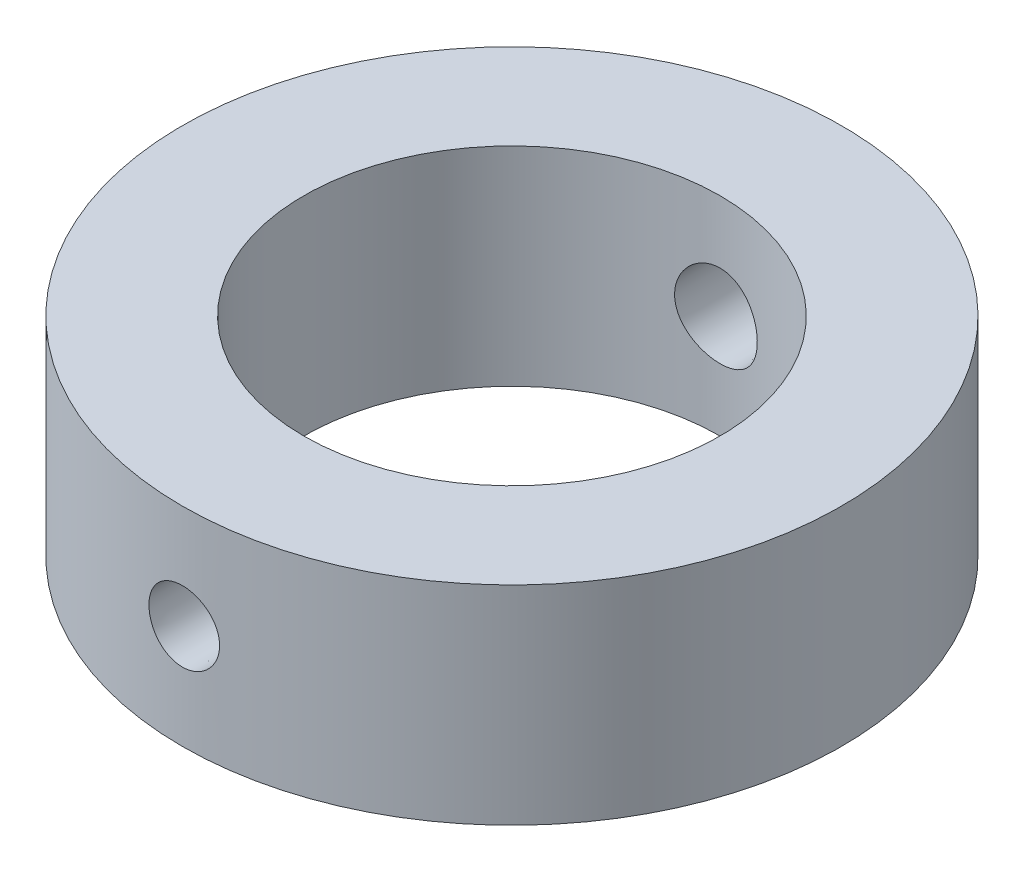
ISO-10303-21;
HEADER;
FILE_DESCRIPTION(('STEP AP214'),'2;1');
FILE_NAME('part.step','',(''),(''),'','','');
FILE_SCHEMA(('AUTOMOTIVE_DESIGN { 1 0 10303 214 1 1 1 1 }'));
ENDSEC;
DATA;
#1=APPLICATION_CONTEXT('core data for automotive mechanical design processes');
#2=APPLICATION_PROTOCOL_DEFINITION('international standard','automotive_design',2000,#1);
#3=PRODUCT_CONTEXT('',#1,'mechanical');
#4=PRODUCT('Part','Part','',(#3));
#5=PRODUCT_RELATED_PRODUCT_CATEGORY('part','',(#4));
#6=PRODUCT_DEFINITION_FORMATION('','',#4);
#7=PRODUCT_DEFINITION_CONTEXT('part definition',#1,'design');
#8=PRODUCT_DEFINITION('design','',#6,#7);
#9=PRODUCT_DEFINITION_SHAPE('','',#8);
#10=(LENGTH_UNIT() NAMED_UNIT(*) SI_UNIT(.MILLI.,.METRE.));
#11=(NAMED_UNIT(*) PLANE_ANGLE_UNIT() SI_UNIT($,.RADIAN.));
#12=(NAMED_UNIT(*) SI_UNIT($,.STERADIAN.) SOLID_ANGLE_UNIT());
#13=UNCERTAINTY_MEASURE_WITH_UNIT(LENGTH_MEASURE(1.E-05),#10,'distance_accuracy_value','');
#14=(GEOMETRIC_REPRESENTATION_CONTEXT(3) GLOBAL_UNCERTAINTY_ASSIGNED_CONTEXT((#13)) GLOBAL_UNIT_ASSIGNED_CONTEXT((#10,
#11,#12)) REPRESENTATION_CONTEXT('',''));
#15=CARTESIAN_POINT('',(0.,0.,0.));
#16=DIRECTION('',(0.,0.,1.));
#17=DIRECTION('',(1.,0.,0.));
#18=AXIS2_PLACEMENT_3D('',#15,#16,#17);
#19=CARTESIAN_POINT('',(0.,6.,0.));
#20=DIRECTION('',(0.,-1.,0.));
#21=DIRECTION('',(0.,0.,-1.));
#22=AXIS2_PLACEMENT_3D('',#19,#20,#21);
#23=CYLINDRICAL_SURFACE('',#22,19.);
#24=CARTESIAN_POINT('',(-1.46623353358241,-1.41078162204729,18.9433407619933));
#25=CARTESIAN_POINT('',(-1.38694834160725,-1.49307584821058,18.9494770095134));
#26=CARTESIAN_POINT('',(-1.30066474146503,-1.56872852395636,18.955653062985));
#27=CARTESIAN_POINT('',(-1.11653154985467,-1.7045544731607,18.9673895643504));
#28=CARTESIAN_POINT('',(-1.01866950960214,-1.76471086067664,18.972949336972));
#29=CARTESIAN_POINT('',(-0.814200704638679,-1.86775106656923,18.9828221185846));
#30=CARTESIAN_POINT('',(-0.707596253034273,-1.9106394361617,18.9871354560054));
#31=CARTESIAN_POINT('',(-0.488674658291428,-1.97790536461394,18.9940300857762));
#32=CARTESIAN_POINT('',(-0.376358966381589,-2.00228760105872,18.9966118157857));
#33=CARTESIAN_POINT('',(-0.149568141769073,-2.03179725696439,18.9997485472412));
#34=CARTESIAN_POINT('',(-0.0351011900236763,-2.03698684128808,19.0003100918919));
#35=CARTESIAN_POINT('',(0.193080029527431,-2.02813017477846,18.9993615209834));
#36=CARTESIAN_POINT('',(0.306794280998336,-2.01408350785385,18.997851360612));
#37=CARTESIAN_POINT('',(0.529938500420432,-1.96722701708078,18.9929353948246));
#38=CARTESIAN_POINT('',(0.639378701267082,-1.93446537172119,18.9895344574876));
#39=CARTESIAN_POINT('',(0.851206142194518,-1.85116063862981,18.9812195095736));
#40=CARTESIAN_POINT('',(0.953593233289825,-1.80061717542366,18.9763054670466));
#41=CARTESIAN_POINT('',(1.14878797407392,-1.68298419100738,18.9654919792438));
#42=CARTESIAN_POINT('',(1.2415622671929,-1.61583962397486,18.9595892772181));
#43=CARTESIAN_POINT('',(1.41455045126307,-1.46697774320227,18.9474689736491));
#44=CARTESIAN_POINT('',(1.49476401655887,-1.3852600517499,18.941251363947));
#45=CARTESIAN_POINT('',(1.64066600370345,-1.20918875205745,18.9291734921693));
#46=CARTESIAN_POINT('',(1.70629745775371,-1.11478782017131,18.9233146942171));
#47=CARTESIAN_POINT('',(1.82076614053261,-0.916245447133162,18.9126446881962));
#48=CARTESIAN_POINT('',(1.86960361037167,-0.812104145850474,18.9078334650879));
#49=CARTESIAN_POINT('',(1.94897652945361,-0.597270976526874,18.8998171585104));
#50=CARTESIAN_POINT('',(1.97955269878468,-0.486594292114096,18.89660850418));
#51=CARTESIAN_POINT('',(2.02167042914208,-0.261639445654727,18.8921492619149));
#52=CARTESIAN_POINT('',(2.03321272608349,-0.147361423022387,18.8908985982776));
#53=CARTESIAN_POINT('',(2.03691028587642,0.0808775084045944,18.8905002465459));
#54=CARTESIAN_POINT('',(2.02917230291266,0.194836681181098,18.8913409784311));
#55=CARTESIAN_POINT('',(1.99476282485654,0.419825381826215,18.895005049082));
#56=CARTESIAN_POINT('',(1.96809139716067,0.530854920121852,18.8978283807904));
#57=CARTESIAN_POINT('',(1.89661771133392,0.746779454706632,18.9051347771338));
#58=CARTESIAN_POINT('',(1.85182650046647,0.851678144331426,18.9096168303386));
#59=CARTESIAN_POINT('',(1.7453988367457,1.05248957655204,18.9197364536716));
#60=CARTESIAN_POINT('',(1.68376181472323,1.14840201538249,18.9253740628409));
#61=CARTESIAN_POINT('',(1.54501602968715,1.329057441294,18.9372063247626));
#62=CARTESIAN_POINT('',(1.4678282726399,1.41373958337498,18.9434037286784));
#63=CARTESIAN_POINT('',(1.30034921162213,1.56898278284673,18.9556357502106));
#64=CARTESIAN_POINT('',(1.21005762530593,1.6395435358887,18.9616703643163));
#65=CARTESIAN_POINT('',(1.01857454356836,1.76476994494364,18.9729206926438));
#66=CARTESIAN_POINT('',(0.917347999100972,1.81938227929094,18.9781336335598));
#67=CARTESIAN_POINT('',(0.707100930910594,1.91082963262551,18.9871289847536));
#68=CARTESIAN_POINT('',(0.598080581027716,1.94766504798337,18.9909114269268));
#69=CARTESIAN_POINT('',(0.375693451388363,2.00240094655346,18.9966097385009));
#70=CARTESIAN_POINT('',(0.262341048033894,2.02035923281589,18.9985313045996));
#71=CARTESIAN_POINT('',(0.0342152603159012,2.03701241085816,19.0003114982579));
#72=CARTESIAN_POINT('',(-0.0805580861131585,2.03570781578972,19.0001701807713));
#73=CARTESIAN_POINT('',(-0.307779582864948,2.01391943085894,18.9978454783354));
#74=CARTESIAN_POINT('',(-0.420235228126301,1.99351279574493,18.9956703083267));
#75=CARTESIAN_POINT('',(-0.640114298456831,1.93422577906844,18.9895328487317));
#76=CARTESIAN_POINT('',(-0.747537670209849,1.89534520182601,18.9855705402156));
#77=CARTESIAN_POINT('',(-0.954500982462602,1.80015124948029,18.9762927503102));
#78=CARTESIAN_POINT('',(-1.05402821904665,1.74381046988421,18.9709751440728));
#79=CARTESIAN_POINT('',(-1.242237666401,1.61530957996412,18.9595819700751));
#80=CARTESIAN_POINT('',(-1.33091950669411,1.5431489294706,18.9535063764365));
#81=CARTESIAN_POINT('',(-1.49535163451622,1.38465358844763,18.9412451298154));
#82=CARTESIAN_POINT('',(-1.57104005748207,1.29825473023346,18.9350590971466));
#83=CARTESIAN_POINT('',(-1.70684284450207,1.11394040053709,18.9233017190715));
#84=CARTESIAN_POINT('',(-1.76695716767556,1.0160248988257,18.9177303752787));
#85=CARTESIAN_POINT('',(-1.86989125269594,0.811423834573686,18.9078341752772));
#86=CARTESIAN_POINT('',(-1.91271033064892,0.704737925431637,18.9035093683614));
#87=CARTESIAN_POINT('',(-1.97979557416775,0.485635004188782,18.8966017136147));
#88=CARTESIAN_POINT('',(-2.00406307516069,0.373218405230685,18.8940187404004));
#89=CARTESIAN_POINT('',(-2.03324949067826,0.14649594273074,18.8909003042796));
#90=CARTESIAN_POINT('',(-2.03827285058017,0.032203668473615,18.8903537891731));
#91=CARTESIAN_POINT('',(-2.02910803506691,-0.195624783891922,18.8913403594047));
#92=CARTESIAN_POINT('',(-2.01491600157378,-0.309160805559578,18.8928738623702));
#93=CARTESIAN_POINT('',(-1.96780075183802,-0.531925813043461,18.8978388498701));
#94=CARTESIAN_POINT('',(-1.93492411386731,-0.641164789513713,18.9012656141624));
#95=CARTESIAN_POINT('',(-1.85144453807356,-0.852490204949246,18.9096245175659));
#96=CARTESIAN_POINT('',(-1.80086007789483,-0.954583967021022,18.9145550868085));
#97=CARTESIAN_POINT('',(-1.70304405782867,-1.11644092160284,18.9235613225868));
#98=CARTESIAN_POINT('',(-1.66030357200172,-1.17898053149131,18.9273750595636));
#99=CARTESIAN_POINT('',(-1.56814230808785,-1.29891090298048,18.9352336356971));
#100=CARTESIAN_POINT('',(-1.51872149400874,-1.35630163683735,18.9392784760989));
#101=CARTESIAN_POINT('',(-1.46623353358241,-1.41078162204729,18.9433407619933));
#102=B_SPLINE_CURVE_WITH_KNOTS('',3,(#24,#25,#26,#27,#28,#29,#30,#31,#32,#33,#34,#35,#36,#37,
#38,#39,#40,#41,#42,#43,#44,#45,#46,#47,#48,#49,#50,#51,#52,#53,#54,#55,#56,#57,#58,#59,#60,#61,
#62,#63,#64,#65,#66,#67,#68,#69,#70,#71,#72,#73,#74,#75,#76,#77,#78,#79,#80,#81,#82,#83,#84,#85,
#86,#87,#88,#89,#90,#91,#92,#93,#94,#95,#96,#97,#98,#99,#100,#101),.UNSPECIFIED.,.T.,.F.,(4,2,2,
2,2,2,2,2,2,2,2,2,2,2,2,2,2,2,2,2,2,2,2,2,2,2,2,2,2,2,2,2,2,2,2,2,2,2,4),(0.,0.343040431735447,
0.686453100295335,1.0297751985355,1.37301049022473,1.71513306670956,2.05726304362145,
2.39851620960005,2.73977658178807,3.08218404540965,3.4246003849804,3.76833179440247,
4.11205826868338,4.45501539234136,4.79795925578463,5.13900847622832,5.48005648266111,
5.82089687167737,6.16174877808626,6.50437788697004,6.84701437951331,7.19078365492888,
7.53454526499345,7.87725115982003,8.21994792518127,8.56126645481713,8.90258859985243,
9.24444920046169,9.58632147571986,9.92977886697421,10.2732371597653,10.6167090323605,
10.9601561779554,11.3017366405709,11.6433856960834,11.984186777753,12.3246332973463,
12.5517298729343,12.7788276721198),.UNSPECIFIED.);
#103=CARTESIAN_POINT('',(-1.46623353358241,-1.41078162204729,18.9433407619933));
#104=VERTEX_POINT('',#103);
#105=EDGE_CURVE('E70',#104,#104,#102,.T.);
#106=ORIENTED_EDGE('',*,*,#105,.F.);
#107=EDGE_LOOP('',(#106));
#108=FACE_BOUND('',#107,.T.);
#109=CARTESIAN_POINT('',(0.,6.,0.));
#110=DIRECTION('',(0.,1.,0.));
#111=DIRECTION('',(0.,0.,1.));
#112=AXIS2_PLACEMENT_3D('',#109,#110,#111);
#113=CIRCLE('',#112,19.);
#114=CARTESIAN_POINT('',(0.,6.,19.));
#115=VERTEX_POINT('',#114);
#116=EDGE_CURVE('E10',#115,#115,#113,.T.);
#117=ORIENTED_EDGE('',*,*,#116,.F.);
#118=EDGE_LOOP('',(#117));
#119=FACE_BOUND('',#118,.T.);
#120=CARTESIAN_POINT('',(0.,-6.,0.));
#121=DIRECTION('',(0.,1.,0.));
#122=DIRECTION('',(0.,0.,1.));
#123=AXIS2_PLACEMENT_3D('',#120,#121,#122);
#124=CIRCLE('',#123,19.);
#125=CARTESIAN_POINT('',(0.,-6.,19.));
#126=VERTEX_POINT('',#125);
#127=EDGE_CURVE('E43',#126,#126,#124,.T.);
#128=ORIENTED_EDGE('',*,*,#127,.T.);
#129=EDGE_LOOP('',(#128));
#130=FACE_BOUND('',#129,.T.);
#131=CARTESIAN_POINT('',(-1.79993109503081,-1.68409257517337,-18.9145512252644));
#132=CARTESIAN_POINT('',(-1.89434127042053,-1.58303112899496,-18.9055671815194));
#133=CARTESIAN_POINT('',(-1.98029123187666,-1.47394163948278,-18.8966741007506));
#134=CARTESIAN_POINT('',(-2.13278191729114,-1.24275537186224,-18.8800731048836));
#135=CARTESIAN_POINT('',(-2.19930297361081,-1.12064558293382,-18.872366394439));
#136=CARTESIAN_POINT('',(-2.31094950360172,-0.866904318382056,-18.8590213694407));
#137=CARTESIAN_POINT('',(-2.35607767636406,-0.735274046352873,-18.8533827939755));
#138=CARTESIAN_POINT('',(-2.42360264299005,-0.466254625922797,-18.8448221506558));
#139=CARTESIAN_POINT('',(-2.44600515310181,-0.328866934759493,-18.841899399698));
#140=CARTESIAN_POINT('',(-2.46737410824489,-0.0529631165517056,-18.8391131160437));
#141=CARTESIAN_POINT('',(-2.46646070799178,0.0855435493563515,-18.8392338989537));
#142=CARTESIAN_POINT('',(-2.44152046421872,0.360426232147687,-18.8424821031854));
#143=CARTESIAN_POINT('',(-2.41749311231818,0.496802202100253,-18.8456095906382));
#144=CARTESIAN_POINT('',(-2.34712751784194,0.7632053363372,-18.8545016867114));
#145=CARTESIAN_POINT('',(-2.30084588214276,0.893247691817296,-18.8602596026246));
#146=CARTESIAN_POINT('',(-2.18733253203026,1.14373080088947,-18.8737602540111));
#147=CARTESIAN_POINT('',(-2.12010001061884,1.26417118440288,-18.8815030659376));
#148=CARTESIAN_POINT('',(-1.96611504008088,1.49281758727882,-18.8981587446942));
#149=CARTESIAN_POINT('',(-1.87924797814008,1.60094592774531,-18.9070783481402));
#150=CARTESIAN_POINT('',(-1.68864597098826,1.80113447773994,-18.9250526092593));
#151=CARTESIAN_POINT('',(-1.58491047908842,1.89319416629868,-18.934107271301));
#152=CARTESIAN_POINT('',(-1.36290563051137,2.05906820646546,-18.9513830944408));
#153=CARTESIAN_POINT('',(-1.24456911855583,2.13279316625136,-18.9596000608785));
#154=CARTESIAN_POINT('',(-0.997079214082562,2.2592936334812,-18.9742240642974));
#155=CARTESIAN_POINT('',(-0.867926153293852,2.31206978311228,-18.9806311567588));
#156=CARTESIAN_POINT('',(-0.603079374661805,2.39492302697291,-18.9908863690843));
#157=CARTESIAN_POINT('',(-0.467418027430139,2.42510212737635,-18.9947459791552));
#158=CARTESIAN_POINT('',(-0.192905267489263,2.46224486428162,-18.999516392258));
#159=CARTESIAN_POINT('',(-0.0540540192241201,2.46920969482104,-19.0004273469555));
#160=CARTESIAN_POINT('',(0.221791564187969,2.45975107297692,-18.9992024553751));
#161=CARTESIAN_POINT('',(0.358792021269446,2.44350206849375,-18.9970893342914));
#162=CARTESIAN_POINT('',(0.62809818511057,2.38841697758344,-18.9900933425263));
#163=CARTESIAN_POINT('',(0.760403870722332,2.34958078942466,-18.98521045937));
#164=CARTESIAN_POINT('',(1.0166965752623,2.25042841061552,-18.9732130331122));
#165=CARTESIAN_POINT('',(1.14067779419093,2.19009742448985,-18.9660969532415));
#166=CARTESIAN_POINT('',(1.37680169589644,2.04968691058366,-18.9504205163906));
#167=CARTESIAN_POINT('',(1.48894377770878,1.96960638098738,-18.9418600861512));
#168=CARTESIAN_POINT('',(1.6991430464436,1.7912339491903,-18.924168269077));
#169=CARTESIAN_POINT('',(1.79708320515948,1.69280450272265,-18.9150329401192));
#170=CARTESIAN_POINT('',(1.97510657093987,1.48089705104874,-18.8972743725409));
#171=CARTESIAN_POINT('',(2.05518936085315,1.36741869439606,-18.8886511458866));
#172=CARTESIAN_POINT('',(2.19548583213867,1.12815081018986,-18.8728604844089));
#173=CARTESIAN_POINT('',(2.25562981431674,1.00232004825011,-18.8656981893664));
#174=CARTESIAN_POINT('',(2.35391561109829,0.742236805318913,-18.8536879535622));
#175=CARTESIAN_POINT('',(2.39205833220758,0.607984671561336,-18.8488399174488));
#176=CARTESIAN_POINT('',(2.44506001384062,0.335668412359441,-18.8420381040689));
#177=CARTESIAN_POINT('',(2.46004796642261,0.197629797517127,-18.8400682959424));
#178=CARTESIAN_POINT('',(2.46669786788221,-0.0790151316717787,-18.8391988880899));
#179=CARTESIAN_POINT('',(2.45836061035519,-0.217621426543938,-18.8402991839095));
#180=CARTESIAN_POINT('',(2.41871743353877,-0.490706097470203,-18.8454290146466));
#181=CARTESIAN_POINT('',(2.38753203713374,-0.625202290847873,-18.8494431780254));
#182=CARTESIAN_POINT('',(2.30324502947134,-0.887039837265575,-18.859927150034));
#183=CARTESIAN_POINT('',(2.25014286844975,-1.0143810107367,-18.8663970202629));
#184=CARTESIAN_POINT('',(2.12331085728023,-1.25881902422316,-18.8810916700616));
#185=CARTESIAN_POINT('',(2.04950631991498,-1.37587671871695,-18.889322777597));
#186=CARTESIAN_POINT('',(1.88342503606467,-1.59599355964774,-18.9066036029196));
#187=CARTESIAN_POINT('',(1.79114741784982,-1.69905204508797,-18.9156533593273));
#188=CARTESIAN_POINT('',(1.59000187709416,-1.88895155150159,-18.9336244354928));
#189=CARTESIAN_POINT('',(1.48102810187655,-1.97568061758701,-18.9425445072871));
#190=CARTESIAN_POINT('',(1.24998043402705,-2.12960988468283,-18.9591915002334));
#191=CARTESIAN_POINT('',(1.12790663282844,-2.1968102219843,-18.9669184297121));
#192=CARTESIAN_POINT('',(0.874254904982431,-2.30965890353493,-18.9802995084944));
#193=CARTESIAN_POINT('',(0.74268963307872,-2.35533535436329,-18.9859563588036));
#194=CARTESIAN_POINT('',(0.473670742893667,-2.42390260282523,-18.9945711183293));
#195=CARTESIAN_POINT('',(0.336217639607348,-2.44679538906584,-18.9975292630927));
#196=CARTESIAN_POINT('',(0.060498214756317,-2.46901748326635,-19.0003998615086));
#197=CARTESIAN_POINT('',(-0.0777528148156734,-2.46853375110486,-19.0003364806652));
#198=CARTESIAN_POINT('',(-0.352225676926821,-2.44447717893689,-18.9972307901179));
#199=CARTESIAN_POINT('',(-0.488447123293873,-2.42090000045049,-18.9941879206688));
#200=CARTESIAN_POINT('',(-0.754627047604604,-2.35144928939301,-18.9854746188536));
#201=CARTESIAN_POINT('',(-0.884599756685808,-2.30562934254951,-18.979810502935));
#202=CARTESIAN_POINT('',(-1.13492890222721,-2.19307221110609,-18.966487129773));
#203=CARTESIAN_POINT('',(-1.25529443119667,-2.12635510593617,-18.9588297889457));
#204=CARTESIAN_POINT('',(-1.44772163292272,-1.99766517833269,-18.9449290083947));
#205=CARTESIAN_POINT('',(-1.52317538836374,-1.94065395732445,-18.9389850251648));
#206=CARTESIAN_POINT('',(-1.66704489926983,-1.81837395254754,-18.9268636319867));
#207=CARTESIAN_POINT('',(-1.73546058328299,-1.7531050849606,-18.9206862196695));
#208=CARTESIAN_POINT('',(-1.79993109503081,-1.68409257517337,-18.9145512252644));
#209=B_SPLINE_CURVE_WITH_KNOTS('',3,(#131,#132,#133,#134,#135,#136,#137,#138,#139,#140,#141,
#142,#143,#144,#145,#146,#147,#148,#149,#150,#151,#152,#153,#154,#155,#156,#157,#158,#159,#160,
#161,#162,#163,#164,#165,#166,#167,#168,#169,#170,#171,#172,#173,#174,#175,#176,#177,#178,#179,
#180,#181,#182,#183,#184,#185,#186,#187,#188,#189,#190,#191,#192,#193,#194,#195,#196,#197,#198,
#199,#200,#201,#202,#203,#204,#205,#206,#207,#208),.UNSPECIFIED.,.T.,.F.,(4,2,2,2,2,2,2,2,2,2,2,
2,2,2,2,2,2,2,2,2,2,2,2,2,2,2,2,2,2,2,2,2,2,2,2,2,2,2,4),(0.,0.415431018477504,
0.831281126536162,1.24707875376631,1.66277176832932,2.07632301173493,2.48988335121545,
2.90239726271737,3.31492706562874,3.72993014312064,4.14494667312623,4.56194862467312,
4.97893779201025,5.39403307292335,5.80910700287332,6.2210780831756,6.63305101899137,
7.04530807699448,7.45758605146095,7.87308873131583,8.2886011163686,8.70555103917198,
9.12248378139055,9.5370853638728,9.95167284050593,10.3640889904715,10.77651548619,
11.1904494497917,11.6044029512095,12.0210986799695,12.4377915005385,12.8539386720198,
13.2700495180988,13.6828329628359,14.0956939705413,14.507565241683,14.9190419663367,
15.2027272615852,15.4864154365791),.UNSPECIFIED.);
#210=CARTESIAN_POINT('',(-1.79993109503081,-1.68409257517337,-18.9145512252644));
#211=VERTEX_POINT('',#210);
#212=EDGE_CURVE('E74',#211,#211,#209,.T.);
#213=ORIENTED_EDGE('',*,*,#212,.F.);
#214=EDGE_LOOP('',(#213));
#215=FACE_BOUND('',#214,.T.);
#216=ADVANCED_FACE('F31',(#108,#119,#130,#215),#23,.T.);
#217=CARTESIAN_POINT('',(0.,6.,0.));
#218=DIRECTION('',(0.,-1.,0.));
#219=DIRECTION('',(0.,0.,-1.));
#220=AXIS2_PLACEMENT_3D('',#217,#218,#219);
#221=CYLINDRICAL_SURFACE('',#220,12.);
#222=CARTESIAN_POINT('',(-1.54909249414774,-1.43965124128201,11.8995929528944));
#223=CARTESIAN_POINT('',(-1.46816649983692,-1.52654729201391,11.9101271159952));
#224=CARTESIAN_POINT('',(-1.37987067662692,-1.60665176283002,11.920779560886));
#225=CARTESIAN_POINT('',(-1.19096698929856,-1.75101077517751,11.9411313791838));
#226=CARTESIAN_POINT('',(-1.09034831677394,-1.81525125124342,11.9508299022659));
#227=CARTESIAN_POINT('',(-0.879591569962721,-1.92599892293281,11.9681863157843));
#228=CARTESIAN_POINT('',(-0.769452483267084,-1.97250422973031,11.9758439888404));
#229=CARTESIAN_POINT('',(-0.542798969972667,-2.04636131392292,11.9882540774579));
#230=CARTESIAN_POINT('',(-0.42628622897826,-2.07371812926107,11.9930072571458));
#231=CARTESIAN_POINT('',(-0.191304867610078,-2.1082886486683,11.9990452280305));
#232=CARTESIAN_POINT('',(-0.0728636721976153,-2.11568328377897,12.0003611697295));
#233=CARTESIAN_POINT('',(0.163579686531177,-2.11061791077759,11.9994673839243));
#234=CARTESIAN_POINT('',(0.28158185549913,-2.09815815914523,11.9972577019643));
#235=CARTESIAN_POINT('',(0.51285295665406,-2.05394641996661,11.9895902357434));
#236=CARTESIAN_POINT('',(0.626151341199644,-2.02234373997833,11.984157596016));
#237=CARTESIAN_POINT('',(0.845830591579429,-1.94091818291238,11.9706596479695));
#238=CARTESIAN_POINT('',(0.952211096833091,-1.89109435698928,11.9625942025524));
#239=CARTESIAN_POINT('',(1.15603558135028,-1.77415410386479,11.9446284906715));
#240=CARTESIAN_POINT('',(1.25339616260032,-1.70689466969762,11.9347132502253));
#241=CARTESIAN_POINT('',(1.43553083949791,-1.5571560039648,11.9141792101098));
#242=CARTESIAN_POINT('',(1.52030391742255,-1.47467554295887,11.903560353652));
#243=CARTESIAN_POINT('',(1.67585902911276,-1.29568960448509,11.8826655675487));
#244=CARTESIAN_POINT('',(1.74646854986241,-1.199033439511,11.8723950008192));
#245=CARTESIAN_POINT('',(1.87044180060612,-0.995081112921398,11.8534971747876));
#246=CARTESIAN_POINT('',(1.92380601475655,-0.88778525012248,11.8448698693542));
#247=CARTESIAN_POINT('',(2.01151431419111,-0.666020141507591,11.8302912459855));
#248=CARTESIAN_POINT('',(2.04593618445118,-0.551582413536111,11.8243290034592));
#249=CARTESIAN_POINT('',(2.09501968066684,-0.318427287457896,11.8157320065792));
#250=CARTESIAN_POINT('',(2.10968342092952,-0.199710348663428,11.8130968961928));
#251=CARTESIAN_POINT('',(2.11871692022258,0.0367530733788051,11.8114799379129));
#252=CARTESIAN_POINT('',(2.11338366028772,0.154487935831195,11.8124446273624));
#253=CARTESIAN_POINT('',(2.08325561735551,0.387356737768559,11.8177948722257));
#254=CARTESIAN_POINT('',(2.0584611275902,0.502490716415454,11.8221803760965));
#255=CARTESIAN_POINT('',(1.99027858656701,0.726575444601157,11.833848597597));
#256=CARTESIAN_POINT('',(1.94694583571914,0.835543501310923,11.8411226938392));
#257=CARTESIAN_POINT('',(1.84296649096917,1.04470690774657,11.8577499495437));
#258=CARTESIAN_POINT('',(1.78231845382647,1.14490152529045,11.8671032822973));
#259=CARTESIAN_POINT('',(1.64448104222243,1.33512171843489,11.8869920629508));
#260=CARTESIAN_POINT('',(1.56708139314219,1.42499345946605,11.8975416411458));
#261=CARTESIAN_POINT('',(1.39836371085199,1.59057339740384,11.918548200363));
#262=CARTESIAN_POINT('',(1.30704478440421,1.66628068464401,11.9290051753971));
#263=CARTESIAN_POINT('',(1.11202988179445,1.80209911663209,11.9487685549213));
#264=CARTESIAN_POINT('',(1.0082240237781,1.86205439822823,11.9580630165484));
#265=CARTESIAN_POINT('',(0.7918411133617,1.96366062511017,11.9743368946069));
#266=CARTESIAN_POINT('',(0.679264562992221,2.00531261716329,11.9813164434228));
#267=CARTESIAN_POINT('',(0.449451043678543,2.06879932728603,11.9921272392552));
#268=CARTESIAN_POINT('',(0.332257069294344,2.090785470651,11.9959825208149));
#269=CARTESIAN_POINT('',(0.0957836793156289,2.11480397452343,12.0002001155731));
#270=CARTESIAN_POINT('',(-0.0234955706162954,2.11683791296193,12.0005627049931));
#271=CARTESIAN_POINT('',(-0.259264198939198,2.10098659288823,11.9977715853272));
#272=CARTESIAN_POINT('',(-0.375769890230883,2.08333524359815,11.9946591673083));
#273=CARTESIAN_POINT('',(-0.60413199388904,2.02903022714622,11.9853281616923));
#274=CARTESIAN_POINT('',(-0.715988318181909,1.99237620019106,11.9791095152826));
#275=CARTESIAN_POINT('',(-0.932264040617424,1.90102122532506,11.9642249292619));
#276=CARTESIAN_POINT('',(-1.03666145948587,1.84626941656201,11.9555521025792));
#277=CARTESIAN_POINT('',(-1.23485121673985,1.72029996304184,11.9367108745469));
#278=CARTESIAN_POINT('',(-1.32864261013071,1.64908085277017,11.9265423401154));
#279=CARTESIAN_POINT('',(-1.50425038641622,1.49109068208978,11.9056778449126));
#280=CARTESIAN_POINT('',(-1.58589480253049,1.4041290634307,11.894976738046));
#281=CARTESIAN_POINT('',(-1.73346690478321,1.2176717144748,11.8743698634896));
#282=CARTESIAN_POINT('',(-1.79939421593434,1.11817568521166,11.8644641147797));
#283=CARTESIAN_POINT('',(-1.91379533307425,0.909096627750625,11.8465506985143));
#284=CARTESIAN_POINT('',(-1.96222229883802,0.799487500353638,11.8385481441835));
#285=CARTESIAN_POINT('',(-2.0399019229334,0.573514992062263,11.8254118318194));
#286=CARTESIAN_POINT('',(-2.06915699020643,0.457152461731101,11.8202777133803));
#287=CARTESIAN_POINT('',(-2.10731550629418,0.222636701451135,11.8135344512165));
#288=CARTESIAN_POINT('',(-2.11648573697333,0.104528191286321,11.8118791118723));
#289=CARTESIAN_POINT('',(-2.11497294584302,-0.131575135760425,11.8121501260433));
#290=CARTESIAN_POINT('',(-2.10428770396364,-0.249569938452631,11.8140768800778));
#291=CARTESIAN_POINT('',(-2.06359318169169,-0.480948637401061,11.8212519543766));
#292=CARTESIAN_POINT('',(-2.03376046454908,-0.594364700248124,11.8264699181284));
#293=CARTESIAN_POINT('',(-1.95585286324008,-0.814505949809691,11.8396025400539));
#294=CARTESIAN_POINT('',(-1.90779217478905,-0.92123626812363,11.8475150992222));
#295=CARTESIAN_POINT('',(-1.80965609940815,-1.09845946764062,11.8628373328655));
#296=CARTESIAN_POINT('',(-1.76339332558945,-1.17113050476336,11.8698375306394));
#297=CARTESIAN_POINT('',(-1.66240558808789,-1.31027143476955,11.8844021291091));
#298=CARTESIAN_POINT('',(-1.60768042042515,-1.37674117811337,11.8919665434027));
#299=CARTESIAN_POINT('',(-1.54909249414774,-1.43965124128201,11.8995929528944));
#300=B_SPLINE_CURVE_WITH_KNOTS('',3,(#222,#223,#224,#225,#226,#227,#228,#229,#230,#231,#232,
#233,#234,#235,#236,#237,#238,#239,#240,#241,#242,#243,#244,#245,#246,#247,#248,#249,#250,#251,
#252,#253,#254,#255,#256,#257,#258,#259,#260,#261,#262,#263,#264,#265,#266,#267,#268,#269,#270,
#271,#272,#273,#274,#275,#276,#277,#278,#279,#280,#281,#282,#283,#284,#285,#286,#287,#288,#289,
#290,#291,#292,#293,#294,#295,#296,#297,#298,#299),.UNSPECIFIED.,.T.,.F.,(4,2,2,2,2,2,2,2,2,2,2,
2,2,2,2,2,2,2,2,2,2,2,2,2,2,2,2,2,2,2,2,2,2,2,2,2,2,2,4),(0.,0.35731915096528,0.714953982800788,
1.07262689272993,1.43020566397719,1.78453239511076,2.13885454907582,2.49044808416091,
2.84205993068698,3.19665234597393,3.55127341512051,3.90998162986504,4.268679773118,
4.62589375009981,4.98306949876529,5.33496188687608,5.68684897295087,6.03769360522019,
6.38856748916384,6.74413157377026,7.09971848550303,7.45870157141782,7.81766412437413,
8.17383829239183,8.52998429195384,8.8819430763877,9.23390852498999,9.58687164624301,
9.93986619169896,10.297460461878,10.6550632628843,11.0136162313671,11.3721241391693,
11.7258404400615,12.0795962928791,12.4301360548114,12.7804033794833,13.0390851982604,
13.2977732533475),.UNSPECIFIED.);
#301=CARTESIAN_POINT('',(-1.54909249414774,-1.43965124128201,11.8995929528944));
#302=VERTEX_POINT('',#301);
#303=EDGE_CURVE('E53',#302,#302,#300,.T.);
#304=ORIENTED_EDGE('',*,*,#303,.T.);
#305=EDGE_LOOP('',(#304));
#306=FACE_BOUND('',#305,.T.);
#307=CARTESIAN_POINT('',(0.,6.,0.));
#308=DIRECTION('',(0.,1.,0.));
#309=DIRECTION('',(0.,0.,1.));
#310=AXIS2_PLACEMENT_3D('',#307,#308,#309);
#311=CIRCLE('',#310,12.);
#312=CARTESIAN_POINT('',(0.,6.,12.));
#313=VERTEX_POINT('',#312);
#314=EDGE_CURVE('E48',#313,#313,#311,.T.);
#315=ORIENTED_EDGE('',*,*,#314,.T.);
#316=EDGE_LOOP('',(#315));
#317=FACE_BOUND('',#316,.T.);
#318=CARTESIAN_POINT('',(0.,-6.,0.));
#319=DIRECTION('',(0.,1.,0.));
#320=DIRECTION('',(0.,0.,1.));
#321=AXIS2_PLACEMENT_3D('',#318,#319,#320);
#322=CIRCLE('',#321,12.);
#323=CARTESIAN_POINT('',(0.,-6.,12.));
#324=VERTEX_POINT('',#323);
#325=EDGE_CURVE('E51',#324,#324,#322,.T.);
#326=ORIENTED_EDGE('',*,*,#325,.F.);
#327=EDGE_LOOP('',(#326));
#328=FACE_BOUND('',#327,.T.);
#329=CARTESIAN_POINT('',(-1.73729029022469,-1.63392144181278,-11.873576649329));
#330=CARTESIAN_POINT('',(-1.82868060768877,-1.53652153948636,-11.8602050659851));
#331=CARTESIAN_POINT('',(-1.91192505431367,-1.43137753643737,-11.8469460338405));
#332=CARTESIAN_POINT('',(-2.0597730712612,-1.20844426570979,-11.8221395864496));
#333=CARTESIAN_POINT('',(-2.12436275893894,-1.09064566961692,-11.8105934490104));
#334=CARTESIAN_POINT('',(-2.23299683781365,-0.845613050724364,-11.790538247505));
#335=CARTESIAN_POINT('',(-2.27703351636797,-0.718375506625594,-11.782030323828));
#336=CARTESIAN_POINT('',(-2.34314602830769,-0.458144404634998,-11.76906181622));
#337=CARTESIAN_POINT('',(-2.36522763543309,-0.325152369663339,-11.7646001682275));
#338=CARTESIAN_POINT('',(-2.38660047159272,-0.0589711173365218,-11.760283032818));
#339=CARTESIAN_POINT('',(-2.38617633588918,0.0741943446815945,-11.7603700176005));
#340=CARTESIAN_POINT('',(-2.36325814431466,0.338531751354686,-11.7649965509005));
#341=CARTESIAN_POINT('',(-2.34076409275259,0.469703696398869,-11.7695360985487));
#342=CARTESIAN_POINT('',(-2.27462873164534,0.725499031767453,-11.7824945845516));
#343=CARTESIAN_POINT('',(-2.23112235193762,0.850158656465664,-11.7908887539056));
#344=CARTESIAN_POINT('',(-2.12431218486182,1.09043635382469,-11.8105982757206));
#345=CARTESIAN_POINT('',(-2.06100663896791,1.20605362221922,-11.8219138876431));
#346=CARTESIAN_POINT('',(-1.91532402516583,1.42676973116308,-11.8463939318317));
#347=CARTESIAN_POINT('',(-1.83268645440868,1.53169393429212,-11.859582552389));
#348=CARTESIAN_POINT('',(-1.65110676342342,1.7263032747893,-11.8862209677872));
#349=CARTESIAN_POINT('',(-1.55216326455733,1.8159871223084,-11.8996707846269));
#350=CARTESIAN_POINT('',(-1.33931219701859,1.97865900609135,-11.9255127577848));
#351=CARTESIAN_POINT('',(-1.2252372009838,2.05143061789778,-11.9378900537514));
#352=CARTESIAN_POINT('',(-0.986223547201479,2.17672418221211,-11.9600061165621));
#353=CARTESIAN_POINT('',(-0.861285630585012,2.22924751484784,-11.9697450632233));
#354=CARTESIAN_POINT('',(-0.605333006229458,2.31201795029523,-11.9854011798583));
#355=CARTESIAN_POINT('',(-0.474388179355353,2.34247413811119,-11.9913541539509));
#356=CARTESIAN_POINT('',(-0.209124710994746,2.3809440929466,-11.9989107493917));
#357=CARTESIAN_POINT('',(-0.074806470854264,2.38896051705587,-12.0005148856845));
#358=CARTESIAN_POINT('',(0.19093291150285,2.38235114583593,-11.9992042722375));
#359=CARTESIAN_POINT('',(0.322364228377329,2.36811136632635,-11.9963665614684));
#360=CARTESIAN_POINT('',(0.580920335146984,2.31816201097606,-11.9866290187046));
#361=CARTESIAN_POINT('',(0.708045100650563,2.28245231355472,-11.9797291637065));
#362=CARTESIAN_POINT('',(0.954565957499128,2.19062227484354,-11.9626125034093));
#363=CARTESIAN_POINT('',(1.07395550451654,2.13448490979731,-11.9523929323309));
#364=CARTESIAN_POINT('',(1.30170999935352,2.0034319000083,-11.9297387443338));
#365=CARTESIAN_POINT('',(1.4100737382214,1.92851419916246,-11.9173038849249));
#366=CARTESIAN_POINT('',(1.61473450669401,1.76048455933293,-11.8913193190564));
#367=CARTESIAN_POINT('',(1.71078650914677,1.66707650390837,-11.877753882125));
#368=CARTESIAN_POINT('',(1.88597195371951,1.46547248647949,-11.8512016062542));
#369=CARTESIAN_POINT('',(1.9651043109154,1.35727557691077,-11.8382148044604));
#370=CARTESIAN_POINT('',(2.1048579983255,1.12800978795488,-11.8141721260405));
#371=CARTESIAN_POINT('',(2.1653129106338,1.00683745324029,-11.8031339644632));
#372=CARTESIAN_POINT('',(2.2649595320027,0.755801242160498,-11.7844196626434));
#373=CARTESIAN_POINT('',(2.30415338821284,0.625938244952015,-11.7767431829205));
#374=CARTESIAN_POINT('',(2.35968098720713,0.362989252801299,-11.765742854652));
#375=CARTESIAN_POINT('',(2.37630360575324,0.229966596302838,-11.7623640390475));
#376=CARTESIAN_POINT('',(2.38709177738534,-0.0370176666684091,-11.7601797112237));
#377=CARTESIAN_POINT('',(2.3812592911599,-0.170979190143629,-11.7613737997169));
#378=CARTESIAN_POINT('',(2.34756237038345,-0.434140144752795,-11.7681448103194));
#379=CARTESIAN_POINT('',(2.31999559522212,-0.563379406369738,-11.7736625126706));
#380=CARTESIAN_POINT('',(2.24404898556013,-0.815366737264585,-11.7883725669373));
#381=CARTESIAN_POINT('',(2.19566804108723,-0.938114459971441,-11.797565114822));
#382=CARTESIAN_POINT('',(2.07905286978814,-1.17472247476778,-11.8186742361753));
#383=CARTESIAN_POINT('',(2.01066684497798,-1.28850604146985,-11.8306114823484));
#384=CARTESIAN_POINT('',(1.85609709801537,-1.50310000706222,-11.8558432252315));
#385=CARTESIAN_POINT('',(1.76991140959504,-1.60390897069386,-11.8691378718067));
#386=CARTESIAN_POINT('',(1.58047897569848,-1.79143051922905,-11.895854997186));
#387=CARTESIAN_POINT('',(1.47697336956415,-1.87788206638267,-11.9092759478324));
#388=CARTESIAN_POINT('',(1.25674846853079,-2.03220110720412,-11.9345233491933));
#389=CARTESIAN_POINT('',(1.14002922625722,-2.100068674882,-11.9463498062577));
#390=CARTESIAN_POINT('',(0.896722995666122,-2.21515733775149,-11.9670698664223));
#391=CARTESIAN_POINT('',(0.770146865131214,-2.26240078256898,-11.9759666417315));
#392=CARTESIAN_POINT('',(0.510639510479019,-2.33485952760715,-11.9898337052006));
#393=CARTESIAN_POINT('',(0.377709244423414,-2.36007813770007,-11.9948045833301));
#394=CARTESIAN_POINT('',(0.111797718194024,-2.38742359253291,-12.0002029923366));
#395=CARTESIAN_POINT('',(-0.021140648161501,-2.38995286978996,-12.0007096996858));
#396=CARTESIAN_POINT('',(-0.285548848009526,-2.37288815312989,-11.9973306693309));
#397=CARTESIAN_POINT('',(-0.417018532036588,-2.35329192788024,-11.9934444886087));
#398=CARTESIAN_POINT('',(-0.673728749249481,-2.29283624200131,-11.9817566789758));
#399=CARTESIAN_POINT('',(-0.799008567759283,-2.25213716485836,-11.9739845989351));
#400=CARTESIAN_POINT('',(-1.04091171036596,-2.15081164425978,-11.9553842474229));
#401=CARTESIAN_POINT('',(-1.15754055335643,-2.0901980416627,-11.9445579459433));
#402=CARTESIAN_POINT('',(-1.3543508069,-1.96638631672996,-11.9236426706216));
#403=CARTESIAN_POINT('',(-1.43685926188869,-1.90678050254157,-11.9139278895786));
#404=CARTESIAN_POINT('',(-1.59357909418225,-1.77758338261313,-11.8939792711876));
#405=CARTESIAN_POINT('',(-1.66779016618535,-1.70799170965889,-11.8837454147605));
#406=CARTESIAN_POINT('',(-1.73729029022469,-1.63392144181278,-11.873576649329));
#407=B_SPLINE_CURVE_WITH_KNOTS('',3,(#329,#330,#331,#332,#333,#334,#335,#336,#337,#338,#339,
#340,#341,#342,#343,#344,#345,#346,#347,#348,#349,#350,#351,#352,#353,#354,#355,#356,#357,#358,
#359,#360,#361,#362,#363,#364,#365,#366,#367,#368,#369,#370,#371,#372,#373,#374,#375,#376,#377,
#378,#379,#380,#381,#382,#383,#384,#385,#386,#387,#388,#389,#390,#391,#392,#393,#394,#395,#396,
#397,#398,#399,#400,#401,#402,#403,#404,#405,#406),.UNSPECIFIED.,.T.,.F.,(4,2,2,2,2,2,2,2,2,2,2,
2,2,2,2,2,2,2,2,2,2,2,2,2,2,2,2,2,2,2,2,2,2,2,2,2,2,2,4),(0.,0.402327927839763,
0.804954496280782,1.20773203157172,1.61040361647421,2.007983750777,2.40556380745651,
2.80062409588341,3.19571948281407,3.59648134119281,3.99727710069233,4.40294955649459,
4.80859435666833,5.2103435601311,5.61204519050426,6.00685656813054,6.40167018152974,
6.79681357616653,7.19200025068167,7.59411946559123,7.99626445752324,8.40189562199757,
8.80748581423673,9.20783456360211,9.60814835693347,10.0030729761224,10.3980186583528,
10.7960425569759,11.1941104474763,11.598769349368,12.0034266396965,12.4076443221912,
12.8118012487607,13.2087753015993,13.6057893924093,13.9998294332366,14.3936158946018,
14.6995652904119,15.0055259399122),.UNSPECIFIED.);
#408=CARTESIAN_POINT('',(-1.73729029022469,-1.63392144181278,-11.873576649329));
#409=VERTEX_POINT('',#408);
#410=EDGE_CURVE('E35',#409,#409,#407,.T.);
#411=ORIENTED_EDGE('',*,*,#410,.T.);
#412=EDGE_LOOP('',(#411));
#413=FACE_BOUND('',#412,.T.);
#414=ADVANCED_FACE('F57',(#306,#317,#328,#413),#221,.F.);
#415=CARTESIAN_POINT('',(0.,6.,0.));
#416=DIRECTION('',(0.,1.,0.));
#417=DIRECTION('',(0.,0.,1.));
#418=AXIS2_PLACEMENT_3D('',#415,#416,#417);
#419=PLANE('',#418);
#420=ORIENTED_EDGE('',*,*,#116,.T.);
#421=EDGE_LOOP('',(#420));
#422=FACE_BOUND('',#421,.T.);
#423=ORIENTED_EDGE('',*,*,#314,.F.);
#424=EDGE_LOOP('',(#423));
#425=FACE_BOUND('',#424,.T.);
#426=ADVANCED_FACE('F88',(#422,#425),#419,.T.);
#427=CARTESIAN_POINT('',(0.,-6.,0.));
#428=DIRECTION('',(0.,1.,0.));
#429=DIRECTION('',(0.,0.,1.));
#430=AXIS2_PLACEMENT_3D('',#427,#428,#429);
#431=PLANE('',#430);
#432=ORIENTED_EDGE('',*,*,#127,.F.);
#433=EDGE_LOOP('',(#432));
#434=FACE_BOUND('',#433,.T.);
#435=ORIENTED_EDGE('',*,*,#325,.T.);
#436=EDGE_LOOP('',(#435));
#437=FACE_BOUND('',#436,.T.);
#438=ADVANCED_FACE('F84',(#434,#437),#431,.F.);
#439=CARTESIAN_POINT('',(0.,0.,22.));
#440=DIRECTION('',(0.,0.,-1.));
#441=DIRECTION('',(-1.,0.,0.));
#442=AXIS2_PLACEMENT_3D('',#439,#440,#441);
#443=CONICAL_SURFACE('',#442,2.00000000000001,0.0113631472642906);
#444=ORIENTED_EDGE('',*,*,#303,.F.);
#445=EDGE_LOOP('',(#444));
#446=FACE_BOUND('',#445,.T.);
#447=ORIENTED_EDGE('',*,*,#105,.T.);
#448=EDGE_LOOP('',(#447));
#449=FACE_BOUND('',#448,.T.);
#450=ADVANCED_FACE('F63',(#446,#449),#443,.F.);
#451=ORIENTED_EDGE('',*,*,#410,.F.);
#452=EDGE_LOOP('',(#451));
#453=FACE_BOUND('',#452,.T.);
#454=ORIENTED_EDGE('',*,*,#212,.T.);
#455=EDGE_LOOP('',(#454));
#456=FACE_BOUND('',#455,.T.);
#457=ADVANCED_FACE('F60',(#453,#456),#443,.F.);
#458=CLOSED_SHELL('',(#216,#414,#426,#438,#450,#457));
#459=MANIFOLD_SOLID_BREP('B2',#458);
#460=ADVANCED_BREP_SHAPE_REPRESENTATION('',(#18,#459),#14);
#461=SHAPE_DEFINITION_REPRESENTATION(#9,#460);
ENDSEC;
END-ISO-10303-21;
